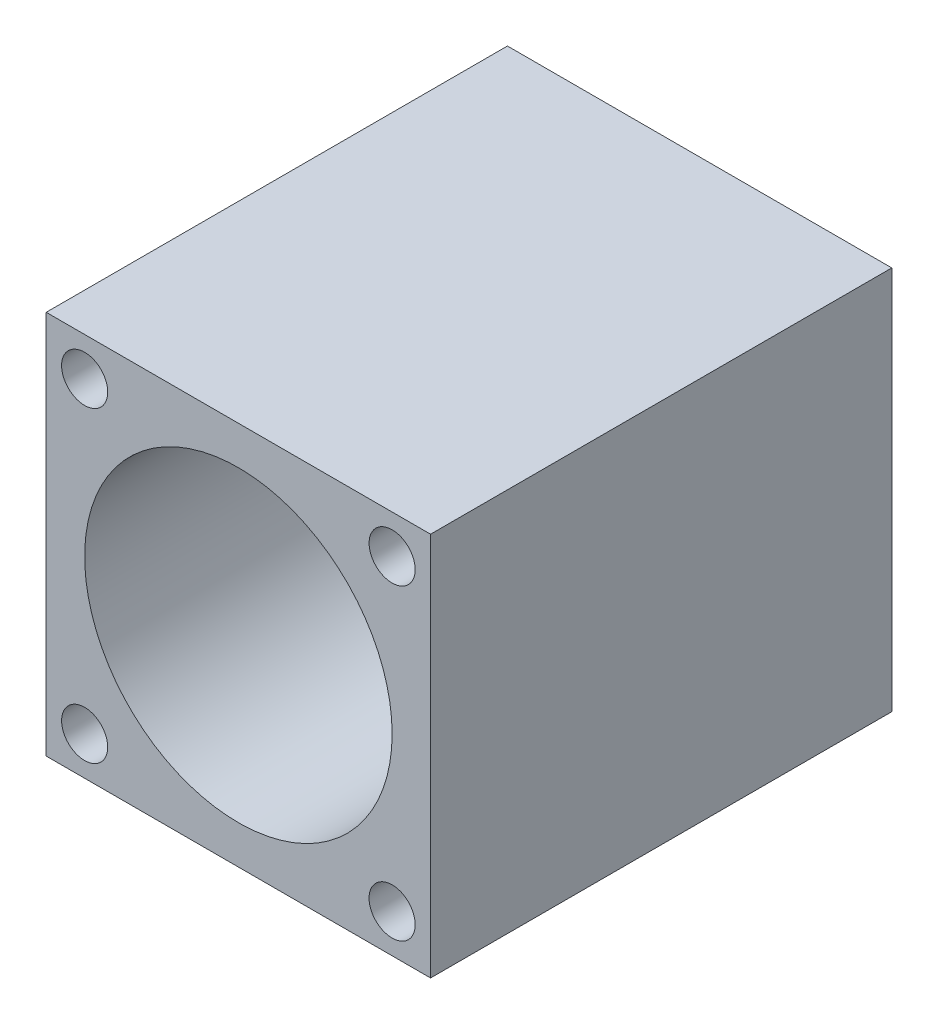
ISO-10303-21;
HEADER;
FILE_DESCRIPTION(('STEP AP214'),'2;1');
FILE_NAME('part.step','',(''),(''),'','','');
FILE_SCHEMA(('AUTOMOTIVE_DESIGN { 1 0 10303 214 1 1 1 1 }'));
ENDSEC;
DATA;
#1=APPLICATION_CONTEXT('core data for automotive mechanical design processes');
#2=APPLICATION_PROTOCOL_DEFINITION('international standard','automotive_design',2000,#1);
#3=PRODUCT_CONTEXT('',#1,'mechanical');
#4=PRODUCT('Part','Part','',(#3));
#5=PRODUCT_RELATED_PRODUCT_CATEGORY('part','',(#4));
#6=PRODUCT_DEFINITION_FORMATION('','',#4);
#7=PRODUCT_DEFINITION_CONTEXT('part definition',#1,'design');
#8=PRODUCT_DEFINITION('design','',#6,#7);
#9=PRODUCT_DEFINITION_SHAPE('','',#8);
#10=(LENGTH_UNIT() NAMED_UNIT(*) SI_UNIT(.MILLI.,.METRE.));
#11=(NAMED_UNIT(*) PLANE_ANGLE_UNIT() SI_UNIT($,.RADIAN.));
#12=(NAMED_UNIT(*) SI_UNIT($,.STERADIAN.) SOLID_ANGLE_UNIT());
#13=UNCERTAINTY_MEASURE_WITH_UNIT(LENGTH_MEASURE(1.E-05),#10,'distance_accuracy_value','');
#14=(GEOMETRIC_REPRESENTATION_CONTEXT(3) GLOBAL_UNCERTAINTY_ASSIGNED_CONTEXT((#13)) GLOBAL_UNIT_ASSIGNED_CONTEXT((#10,
#11,#12)) REPRESENTATION_CONTEXT('',''));
#15=CARTESIAN_POINT('',(0.,0.,0.));
#16=DIRECTION('',(0.,0.,1.));
#17=DIRECTION('',(1.,0.,0.));
#18=AXIS2_PLACEMENT_3D('',#15,#16,#17);
#19=CARTESIAN_POINT('',(0.,0.,30.));
#20=DIRECTION('',(0.,0.,-1.));
#21=DIRECTION('',(-1.,0.,0.));
#22=AXIS2_PLACEMENT_3D('',#19,#20,#21);
#23=CYLINDRICAL_SURFACE('',#22,3.);
#24=CARTESIAN_POINT('',(0.,0.,0.));
#25=DIRECTION('',(0.,0.,1.));
#26=DIRECTION('',(1.,0.,0.));
#27=AXIS2_PLACEMENT_3D('',#24,#25,#26);
#28=CIRCLE('',#27,3.);
#29=CARTESIAN_POINT('',(3.,0.,0.));
#30=VERTEX_POINT('',#29);
#31=EDGE_CURVE('E100',#30,#30,#28,.T.);
#32=ORIENTED_EDGE('',*,*,#31,.F.);
#33=EDGE_LOOP('',(#32));
#34=FACE_BOUND('',#33,.T.);
#35=CARTESIAN_POINT('',(0.,0.,2.));
#36=DIRECTION('',(0.,0.,1.));
#37=DIRECTION('',(1.,0.,0.));
#38=AXIS2_PLACEMENT_3D('',#35,#36,#37);
#39=CIRCLE('',#38,3.);
#40=CARTESIAN_POINT('',(3.,0.,2.));
#41=VERTEX_POINT('',#40);
#42=EDGE_CURVE('E34',#41,#41,#39,.T.);
#43=ORIENTED_EDGE('',*,*,#42,.T.);
#44=EDGE_LOOP('',(#43));
#45=FACE_BOUND('',#44,.T.);
#46=ADVANCED_FACE('F30',(#34,#45),#23,.F.);
#47=CARTESIAN_POINT('',(-12.5,12.5,30.));
#48=DIRECTION('',(0.,0.,-1.));
#49=DIRECTION('',(-1.,0.,0.));
#50=AXIS2_PLACEMENT_3D('',#47,#48,#49);
#51=PLANE('',#50);
#52=CARTESIAN_POINT('',(0.,0.,30.));
#53=DIRECTION('',(0.,0.,1.));
#54=DIRECTION('',(1.,0.,0.));
#55=AXIS2_PLACEMENT_3D('',#52,#53,#54);
#56=CIRCLE('',#55,10.);
#57=CARTESIAN_POINT('',(10.,0.,30.));
#58=VERTEX_POINT('',#57);
#59=EDGE_CURVE('E138',#58,#58,#56,.T.);
#60=ORIENTED_EDGE('',*,*,#59,.F.);
#61=EDGE_LOOP('',(#60));
#62=FACE_BOUND('',#61,.T.);
#63=CARTESIAN_POINT('',(10.,-10.,30.));
#64=DIRECTION('',(0.,0.,1.));
#65=DIRECTION('',(-1.,0.,0.));
#66=AXIS2_PLACEMENT_3D('',#63,#64,#65);
#67=CIRCLE('',#66,1.5);
#68=CARTESIAN_POINT('',(8.5,-10.,30.));
#69=VERTEX_POINT('',#68);
#70=EDGE_CURVE('E124',#69,#69,#67,.T.);
#71=ORIENTED_EDGE('',*,*,#70,.F.);
#72=EDGE_LOOP('',(#71));
#73=FACE_BOUND('',#72,.T.);
#74=CARTESIAN_POINT('',(10.,10.,30.));
#75=DIRECTION('',(0.,0.,1.));
#76=DIRECTION('',(1.,0.,0.));
#77=AXIS2_PLACEMENT_3D('',#74,#75,#76);
#78=CIRCLE('',#77,1.5);
#79=CARTESIAN_POINT('',(11.5,10.,30.));
#80=VERTEX_POINT('',#79);
#81=EDGE_CURVE('E114',#80,#80,#78,.T.);
#82=ORIENTED_EDGE('',*,*,#81,.F.);
#83=EDGE_LOOP('',(#82));
#84=FACE_BOUND('',#83,.T.);
#85=DIRECTION('',(0.,-1.,0.));
#86=VECTOR('',#85,1.);
#87=CARTESIAN_POINT('',(-12.5,-12.5,30.));
#88=LINE('',#87,#86);
#89=CARTESIAN_POINT('',(-12.5,12.5,30.));
#90=VERTEX_POINT('',#89);
#91=CARTESIAN_POINT('',(-12.5,-12.5,30.));
#92=VERTEX_POINT('',#91);
#93=EDGE_CURVE('E84',#90,#92,#88,.T.);
#94=ORIENTED_EDGE('',*,*,#93,.T.);
#95=DIRECTION('',(1.,0.,0.));
#96=VECTOR('',#95,1.);
#97=CARTESIAN_POINT('',(-12.5,-12.5,30.));
#98=LINE('',#97,#96);
#99=CARTESIAN_POINT('',(12.5,-12.5,30.));
#100=VERTEX_POINT('',#99);
#101=EDGE_CURVE('E78',#92,#100,#98,.T.);
#102=ORIENTED_EDGE('',*,*,#101,.T.);
#103=DIRECTION('',(0.,1.,0.));
#104=VECTOR('',#103,1.);
#105=CARTESIAN_POINT('',(12.5,-12.5,30.));
#106=LINE('',#105,#104);
#107=CARTESIAN_POINT('',(12.5,12.5,30.));
#108=VERTEX_POINT('',#107);
#109=EDGE_CURVE('E82',#100,#108,#106,.T.);
#110=ORIENTED_EDGE('',*,*,#109,.T.);
#111=DIRECTION('',(-1.,0.,0.));
#112=VECTOR('',#111,1.);
#113=CARTESIAN_POINT('',(-12.5,12.5,30.));
#114=LINE('',#113,#112);
#115=EDGE_CURVE('E48',#108,#90,#114,.T.);
#116=ORIENTED_EDGE('',*,*,#115,.T.);
#117=EDGE_LOOP('',(#94,#102,#110,#116));
#118=FACE_BOUND('',#117,.T.);
#119=CARTESIAN_POINT('',(-10.,10.,30.));
#120=DIRECTION('',(0.,0.,1.));
#121=DIRECTION('',(-1.,0.,0.));
#122=AXIS2_PLACEMENT_3D('',#119,#120,#121);
#123=CIRCLE('',#122,1.5);
#124=CARTESIAN_POINT('',(-11.5,10.,30.));
#125=VERTEX_POINT('',#124);
#126=EDGE_CURVE('E118',#125,#125,#123,.T.);
#127=ORIENTED_EDGE('',*,*,#126,.F.);
#128=EDGE_LOOP('',(#127));
#129=FACE_BOUND('',#128,.T.);
#130=CARTESIAN_POINT('',(-10.,-10.,30.));
#131=DIRECTION('',(0.,0.,1.));
#132=DIRECTION('',(1.,0.,0.));
#133=AXIS2_PLACEMENT_3D('',#130,#131,#132);
#134=CIRCLE('',#133,1.5);
#135=CARTESIAN_POINT('',(-8.5,-10.,30.));
#136=VERTEX_POINT('',#135);
#137=EDGE_CURVE('E130',#136,#136,#134,.T.);
#138=ORIENTED_EDGE('',*,*,#137,.F.);
#139=EDGE_LOOP('',(#138));
#140=FACE_BOUND('',#139,.T.);
#141=ADVANCED_FACE('F79',(#62,#73,#84,#118,#129,#140),#51,.F.);
#142=CARTESIAN_POINT('',(-12.5,12.5,0.));
#143=DIRECTION('',(0.,0.,-1.));
#144=DIRECTION('',(-1.,0.,0.));
#145=AXIS2_PLACEMENT_3D('',#142,#143,#144);
#146=PLANE('',#145);
#147=CARTESIAN_POINT('',(10.,-10.,0.));
#148=DIRECTION('',(0.,0.,1.));
#149=DIRECTION('',(-1.,0.,0.));
#150=AXIS2_PLACEMENT_3D('',#147,#148,#149);
#151=CIRCLE('',#150,1.5);
#152=CARTESIAN_POINT('',(8.5,-10.,0.));
#153=VERTEX_POINT('',#152);
#154=EDGE_CURVE('E127',#153,#153,#151,.T.);
#155=ORIENTED_EDGE('',*,*,#154,.T.);
#156=EDGE_LOOP('',(#155));
#157=FACE_BOUND('',#156,.T.);
#158=CARTESIAN_POINT('',(10.,10.,0.));
#159=DIRECTION('',(0.,0.,1.));
#160=DIRECTION('',(1.,0.,0.));
#161=AXIS2_PLACEMENT_3D('',#158,#159,#160);
#162=CIRCLE('',#161,1.5);
#163=CARTESIAN_POINT('',(11.5,10.,0.));
#164=VERTEX_POINT('',#163);
#165=EDGE_CURVE('E115',#164,#164,#162,.T.);
#166=ORIENTED_EDGE('',*,*,#165,.T.);
#167=EDGE_LOOP('',(#166));
#168=FACE_BOUND('',#167,.T.);
#169=DIRECTION('',(0.,-1.,0.));
#170=VECTOR('',#169,1.);
#171=CARTESIAN_POINT('',(-12.5,-12.5,0.));
#172=LINE('',#171,#170);
#173=CARTESIAN_POINT('',(-12.5,12.5,0.));
#174=VERTEX_POINT('',#173);
#175=CARTESIAN_POINT('',(-12.5,-12.5,0.));
#176=VERTEX_POINT('',#175);
#177=EDGE_CURVE('E97',#174,#176,#172,.T.);
#178=ORIENTED_EDGE('',*,*,#177,.F.);
#179=DIRECTION('',(-1.,0.,0.));
#180=VECTOR('',#179,1.);
#181=CARTESIAN_POINT('',(-12.5,12.5,0.));
#182=LINE('',#181,#180);
#183=CARTESIAN_POINT('',(12.5,12.5,0.));
#184=VERTEX_POINT('',#183);
#185=EDGE_CURVE('E71',#184,#174,#182,.T.);
#186=ORIENTED_EDGE('',*,*,#185,.F.);
#187=DIRECTION('',(0.,1.,0.));
#188=VECTOR('',#187,1.);
#189=CARTESIAN_POINT('',(12.5,-12.5,0.));
#190=LINE('',#189,#188);
#191=CARTESIAN_POINT('',(12.5,-12.5,0.));
#192=VERTEX_POINT('',#191);
#193=EDGE_CURVE('E65',#192,#184,#190,.T.);
#194=ORIENTED_EDGE('',*,*,#193,.F.);
#195=DIRECTION('',(1.,0.,0.));
#196=VECTOR('',#195,1.);
#197=CARTESIAN_POINT('',(-12.5,-12.5,0.));
#198=LINE('',#197,#196);
#199=EDGE_CURVE('E88',#176,#192,#198,.T.);
#200=ORIENTED_EDGE('',*,*,#199,.F.);
#201=EDGE_LOOP('',(#178,#186,#194,#200));
#202=FACE_BOUND('',#201,.T.);
#203=ORIENTED_EDGE('',*,*,#31,.T.);
#204=EDGE_LOOP('',(#203));
#205=FACE_BOUND('',#204,.T.);
#206=CARTESIAN_POINT('',(-10.,10.,0.));
#207=DIRECTION('',(0.,0.,1.));
#208=DIRECTION('',(-1.,0.,0.));
#209=AXIS2_PLACEMENT_3D('',#206,#207,#208);
#210=CIRCLE('',#209,1.5);
#211=CARTESIAN_POINT('',(-11.5,10.,0.));
#212=VERTEX_POINT('',#211);
#213=EDGE_CURVE('E121',#212,#212,#210,.T.);
#214=ORIENTED_EDGE('',*,*,#213,.T.);
#215=EDGE_LOOP('',(#214));
#216=FACE_BOUND('',#215,.T.);
#217=CARTESIAN_POINT('',(-10.,-10.,0.));
#218=DIRECTION('',(0.,0.,1.));
#219=DIRECTION('',(1.,0.,0.));
#220=AXIS2_PLACEMENT_3D('',#217,#218,#219);
#221=CIRCLE('',#220,1.5);
#222=CARTESIAN_POINT('',(-8.5,-10.,0.));
#223=VERTEX_POINT('',#222);
#224=EDGE_CURVE('E133',#223,#223,#221,.T.);
#225=ORIENTED_EDGE('',*,*,#224,.T.);
#226=EDGE_LOOP('',(#225));
#227=FACE_BOUND('',#226,.T.);
#228=ADVANCED_FACE('F108',(#157,#168,#202,#205,#216,#227),#146,.T.);
#229=CARTESIAN_POINT('',(-12.5,-12.5,30.));
#230=DIRECTION('',(1.,0.,0.));
#231=DIRECTION('',(0.,0.,-1.));
#232=AXIS2_PLACEMENT_3D('',#229,#230,#231);
#233=PLANE('',#232);
#234=ORIENTED_EDGE('',*,*,#177,.T.);
#235=DIRECTION('',(0.,0.,-1.));
#236=VECTOR('',#235,1.);
#237=CARTESIAN_POINT('',(-12.5,-12.5,30.));
#238=LINE('',#237,#236);
#239=EDGE_CURVE('E11',#92,#176,#238,.T.);
#240=ORIENTED_EDGE('',*,*,#239,.F.);
#241=ORIENTED_EDGE('',*,*,#93,.F.);
#242=DIRECTION('',(0.,0.,-1.));
#243=VECTOR('',#242,1.);
#244=CARTESIAN_POINT('',(-12.5,12.5,30.));
#245=LINE('',#244,#243);
#246=EDGE_CURVE('E93',#90,#174,#245,.T.);
#247=ORIENTED_EDGE('',*,*,#246,.T.);
#248=EDGE_LOOP('',(#234,#240,#241,#247));
#249=FACE_BOUND('',#248,.T.);
#250=ADVANCED_FACE('F32',(#249),#233,.F.);
#251=CARTESIAN_POINT('',(-12.5,-12.5,30.));
#252=DIRECTION('',(0.,1.,0.));
#253=DIRECTION('',(0.,0.,1.));
#254=AXIS2_PLACEMENT_3D('',#251,#252,#253);
#255=PLANE('',#254);
#256=ORIENTED_EDGE('',*,*,#199,.T.);
#257=DIRECTION('',(0.,0.,-1.));
#258=VECTOR('',#257,1.);
#259=CARTESIAN_POINT('',(12.5,-12.5,30.));
#260=LINE('',#259,#258);
#261=EDGE_CURVE('E40',#100,#192,#260,.T.);
#262=ORIENTED_EDGE('',*,*,#261,.F.);
#263=ORIENTED_EDGE('',*,*,#101,.F.);
#264=ORIENTED_EDGE('',*,*,#239,.T.);
#265=EDGE_LOOP('',(#256,#262,#263,#264));
#266=FACE_BOUND('',#265,.T.);
#267=ADVANCED_FACE('F87',(#266),#255,.F.);
#268=CARTESIAN_POINT('',(12.5,-12.5,30.));
#269=DIRECTION('',(-1.,0.,0.));
#270=DIRECTION('',(0.,0.,1.));
#271=AXIS2_PLACEMENT_3D('',#268,#269,#270);
#272=PLANE('',#271);
#273=ORIENTED_EDGE('',*,*,#193,.T.);
#274=DIRECTION('',(0.,0.,-1.));
#275=VECTOR('',#274,1.);
#276=CARTESIAN_POINT('',(12.5,12.5,30.));
#277=LINE('',#276,#275);
#278=EDGE_CURVE('E89',#108,#184,#277,.T.);
#279=ORIENTED_EDGE('',*,*,#278,.F.);
#280=ORIENTED_EDGE('',*,*,#109,.F.);
#281=ORIENTED_EDGE('',*,*,#261,.T.);
#282=EDGE_LOOP('',(#273,#279,#280,#281));
#283=FACE_BOUND('',#282,.T.);
#284=ADVANCED_FACE('F91',(#283),#272,.F.);
#285=CARTESIAN_POINT('',(-12.5,12.5,30.));
#286=DIRECTION('',(0.,-1.,0.));
#287=DIRECTION('',(0.,0.,-1.));
#288=AXIS2_PLACEMENT_3D('',#285,#286,#287);
#289=PLANE('',#288);
#290=ORIENTED_EDGE('',*,*,#185,.T.);
#291=ORIENTED_EDGE('',*,*,#246,.F.);
#292=ORIENTED_EDGE('',*,*,#115,.F.);
#293=ORIENTED_EDGE('',*,*,#278,.T.);
#294=EDGE_LOOP('',(#290,#291,#292,#293));
#295=FACE_BOUND('',#294,.T.);
#296=ADVANCED_FACE('F105',(#295),#289,.F.);
#297=CARTESIAN_POINT('',(10.,10.,30.));
#298=DIRECTION('',(0.,0.,-1.));
#299=DIRECTION('',(-1.,0.,0.));
#300=AXIS2_PLACEMENT_3D('',#297,#298,#299);
#301=CYLINDRICAL_SURFACE('',#300,1.5);
#302=ORIENTED_EDGE('',*,*,#81,.T.);
#303=EDGE_LOOP('',(#302));
#304=FACE_BOUND('',#303,.T.);
#305=ORIENTED_EDGE('',*,*,#165,.F.);
#306=EDGE_LOOP('',(#305));
#307=FACE_BOUND('',#306,.T.);
#308=ADVANCED_FACE('F169',(#304,#307),#301,.F.);
#309=CARTESIAN_POINT('',(-10.,10.,30.));
#310=DIRECTION('',(0.,0.,-1.));
#311=DIRECTION('',(-1.,0.,0.));
#312=AXIS2_PLACEMENT_3D('',#309,#310,#311);
#313=CYLINDRICAL_SURFACE('',#312,1.5);
#314=ORIENTED_EDGE('',*,*,#126,.T.);
#315=EDGE_LOOP('',(#314));
#316=FACE_BOUND('',#315,.T.);
#317=ORIENTED_EDGE('',*,*,#213,.F.);
#318=EDGE_LOOP('',(#317));
#319=FACE_BOUND('',#318,.T.);
#320=ADVANCED_FACE('F220',(#316,#319),#313,.F.);
#321=CARTESIAN_POINT('',(10.,-10.,30.));
#322=DIRECTION('',(0.,0.,-1.));
#323=DIRECTION('',(-1.,0.,0.));
#324=AXIS2_PLACEMENT_3D('',#321,#322,#323);
#325=CYLINDRICAL_SURFACE('',#324,1.5);
#326=ORIENTED_EDGE('',*,*,#70,.T.);
#327=EDGE_LOOP('',(#326));
#328=FACE_BOUND('',#327,.T.);
#329=ORIENTED_EDGE('',*,*,#154,.F.);
#330=EDGE_LOOP('',(#329));
#331=FACE_BOUND('',#330,.T.);
#332=ADVANCED_FACE('F212',(#328,#331),#325,.F.);
#333=CARTESIAN_POINT('',(-10.,-10.,30.));
#334=DIRECTION('',(0.,0.,-1.));
#335=DIRECTION('',(-1.,0.,0.));
#336=AXIS2_PLACEMENT_3D('',#333,#334,#335);
#337=CYLINDRICAL_SURFACE('',#336,1.5);
#338=ORIENTED_EDGE('',*,*,#137,.T.);
#339=EDGE_LOOP('',(#338));
#340=FACE_BOUND('',#339,.T.);
#341=ORIENTED_EDGE('',*,*,#224,.F.);
#342=EDGE_LOOP('',(#341));
#343=FACE_BOUND('',#342,.T.);
#344=ADVANCED_FACE('F156',(#340,#343),#337,.F.);
#345=CARTESIAN_POINT('',(0.,0.,2.));
#346=DIRECTION('',(0.,0.,1.));
#347=DIRECTION('',(1.,0.,0.));
#348=AXIS2_PLACEMENT_3D('',#345,#346,#347);
#349=CYLINDRICAL_SURFACE('',#348,10.);
#350=CARTESIAN_POINT('',(0.,0.,2.));
#351=DIRECTION('',(0.,0.,1.));
#352=DIRECTION('',(1.,0.,0.));
#353=AXIS2_PLACEMENT_3D('',#350,#351,#352);
#354=CIRCLE('',#353,10.);
#355=CARTESIAN_POINT('',(10.,0.,2.));
#356=VERTEX_POINT('',#355);
#357=EDGE_CURVE('E141',#356,#356,#354,.T.);
#358=ORIENTED_EDGE('',*,*,#357,.F.);
#359=EDGE_LOOP('',(#358));
#360=FACE_BOUND('',#359,.T.);
#361=ORIENTED_EDGE('',*,*,#59,.T.);
#362=EDGE_LOOP('',(#361));
#363=FACE_BOUND('',#362,.T.);
#364=ADVANCED_FACE('F151',(#360,#363),#349,.F.);
#365=CARTESIAN_POINT('',(0.,0.,2.));
#366=DIRECTION('',(0.,0.,1.));
#367=DIRECTION('',(1.,0.,0.));
#368=AXIS2_PLACEMENT_3D('',#365,#366,#367);
#369=PLANE('',#368);
#370=ORIENTED_EDGE('',*,*,#42,.F.);
#371=EDGE_LOOP('',(#370));
#372=FACE_BOUND('',#371,.T.);
#373=ORIENTED_EDGE('',*,*,#357,.T.);
#374=EDGE_LOOP('',(#373));
#375=FACE_BOUND('',#374,.T.);
#376=ADVANCED_FACE('F149',(#372,#375),#369,.T.);
#377=CLOSED_SHELL('',(#46,#141,#228,#250,#267,#284,#296,#308,#320,#332,#344,#364,#376));
#378=MANIFOLD_SOLID_BREP('B2',#377);
#379=ADVANCED_BREP_SHAPE_REPRESENTATION('',(#18,#378),#14);
#380=SHAPE_DEFINITION_REPRESENTATION(#9,#379);
ENDSEC;
END-ISO-10303-21;
